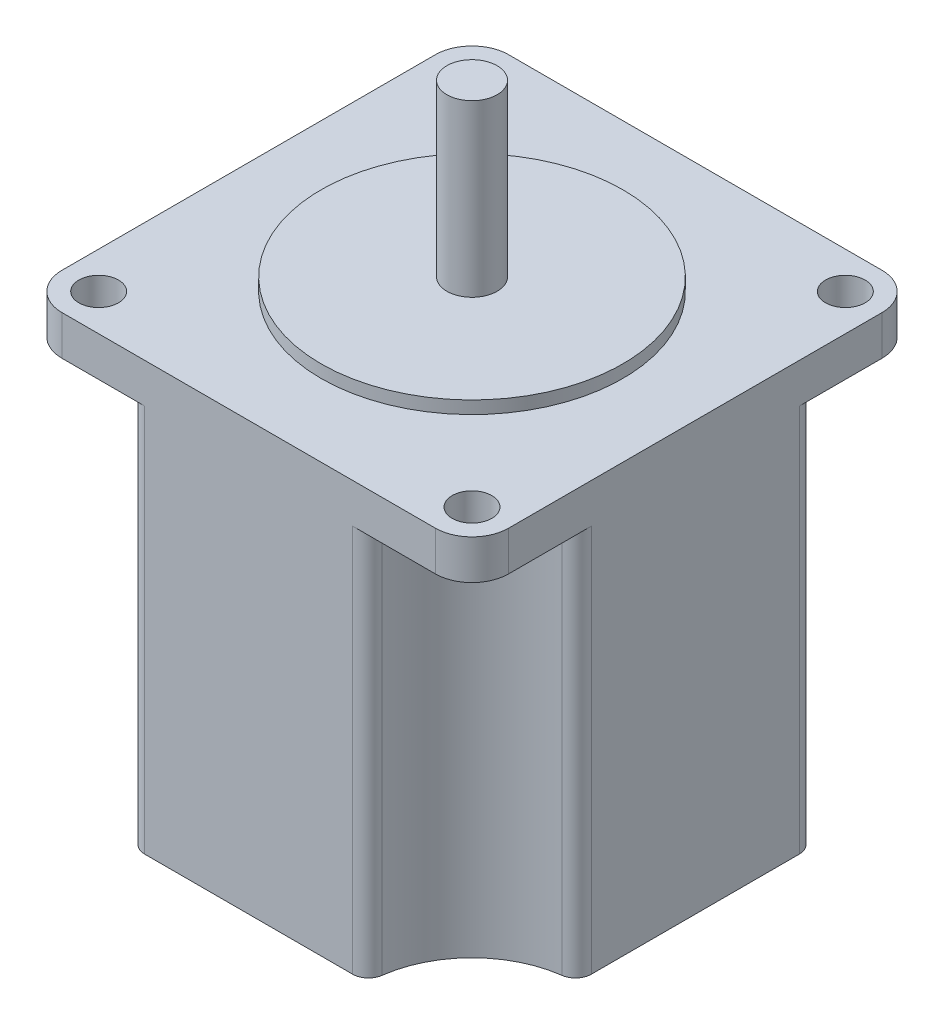
ISO-10303-21;
HEADER;
FILE_DESCRIPTION(('STEP AP214'),'2;1');
FILE_NAME('part.step','',(''),(''),'','','');
FILE_SCHEMA(('AUTOMOTIVE_DESIGN { 1 0 10303 214 1 1 1 1 }'));
ENDSEC;
DATA;
#1=APPLICATION_CONTEXT('core data for automotive mechanical design processes');
#2=APPLICATION_PROTOCOL_DEFINITION('international standard','automotive_design',2000,#1);
#3=PRODUCT_CONTEXT('',#1,'mechanical');
#4=PRODUCT('Part','Part','',(#3));
#5=PRODUCT_RELATED_PRODUCT_CATEGORY('part','',(#4));
#6=PRODUCT_DEFINITION_FORMATION('','',#4);
#7=PRODUCT_DEFINITION_CONTEXT('part definition',#1,'design');
#8=PRODUCT_DEFINITION('design','',#6,#7);
#9=PRODUCT_DEFINITION_SHAPE('','',#8);
#10=(LENGTH_UNIT() NAMED_UNIT(*) SI_UNIT(.MILLI.,.METRE.));
#11=(NAMED_UNIT(*) PLANE_ANGLE_UNIT() SI_UNIT($,.RADIAN.));
#12=(NAMED_UNIT(*) SI_UNIT($,.STERADIAN.) SOLID_ANGLE_UNIT());
#13=UNCERTAINTY_MEASURE_WITH_UNIT(LENGTH_MEASURE(1.E-05),#10,'distance_accuracy_value','');
#14=(GEOMETRIC_REPRESENTATION_CONTEXT(3) GLOBAL_UNCERTAINTY_ASSIGNED_CONTEXT((#13)) GLOBAL_UNIT_ASSIGNED_CONTEXT((#10,
#11,#12)) REPRESENTATION_CONTEXT('',''));
#15=CARTESIAN_POINT('',(0.,0.,0.));
#16=DIRECTION('',(0.,0.,1.));
#17=DIRECTION('',(1.,0.,0.));
#18=AXIS2_PLACEMENT_3D('',#15,#16,#17);
#19=CARTESIAN_POINT('',(28.2,55.6,-28.2));
#20=DIRECTION('',(0.,1.,0.));
#21=DIRECTION('',(0.,0.,1.));
#22=AXIS2_PLACEMENT_3D('',#19,#20,#21);
#23=PLANE('',#22);
#24=CARTESIAN_POINT('',(28.2,55.6,-28.2));
#25=DIRECTION('',(0.,1.,0.));
#26=DIRECTION('',(0.,0.,1.));
#27=AXIS2_PLACEMENT_3D('',#24,#25,#26);
#28=CIRCLE('',#27,19.05);
#29=CARTESIAN_POINT('',(28.2,55.6,-9.14999999999999));
#30=VERTEX_POINT('',#29);
#31=EDGE_CURVE('E366',#30,#30,#28,.T.);
#32=ORIENTED_EDGE('',*,*,#31,.T.);
#33=EDGE_LOOP('',(#32));
#34=FACE_BOUND('',#33,.T.);
#35=CARTESIAN_POINT('',(28.2,55.6,-28.2));
#36=DIRECTION('',(0.,1.,0.));
#37=DIRECTION('',(0.,0.,1.));
#38=AXIS2_PLACEMENT_3D('',#35,#36,#37);
#39=CIRCLE('',#38,3.175);
#40=CARTESIAN_POINT('',(28.2,55.6,-25.025));
#41=VERTEX_POINT('',#40);
#42=EDGE_CURVE('E622',#41,#41,#39,.T.);
#43=ORIENTED_EDGE('',*,*,#42,.F.);
#44=EDGE_LOOP('',(#43));
#45=FACE_BOUND('',#44,.T.);
#46=ADVANCED_FACE('F33',(#34,#45),#23,.T.);
#47=CARTESIAN_POINT('',(4.63,54.,-51.77));
#48=DIRECTION('',(0.,1.,0.));
#49=DIRECTION('',(0.,0.,1.));
#50=AXIS2_PLACEMENT_3D('',#47,#48,#49);
#51=PLANE('',#50);
#52=CARTESIAN_POINT('',(4.63,54.,-51.77));
#53=DIRECTION('',(0.,1.,0.));
#54=DIRECTION('',(0.,0.,1.));
#55=AXIS2_PLACEMENT_3D('',#52,#53,#54);
#56=CIRCLE('',#55,4.63);
#57=CARTESIAN_POINT('',(4.63,54.,-56.4));
#58=VERTEX_POINT('',#57);
#59=CARTESIAN_POINT('',(0.,54.,-51.77));
#60=VERTEX_POINT('',#59);
#61=EDGE_CURVE('E268',#58,#60,#56,.T.);
#62=ORIENTED_EDGE('',*,*,#61,.T.);
#63=DIRECTION('',(0.,0.,1.));
#64=VECTOR('',#63,1.);
#65=CARTESIAN_POINT('',(0.,54.,-51.77));
#66=LINE('',#65,#64);
#67=CARTESIAN_POINT('',(0.,54.,-4.63));
#68=VERTEX_POINT('',#67);
#69=EDGE_CURVE('E271',#60,#68,#66,.T.);
#70=ORIENTED_EDGE('',*,*,#69,.T.);
#71=CARTESIAN_POINT('',(4.63,54.,-4.63));
#72=DIRECTION('',(0.,1.,0.));
#73=DIRECTION('',(0.,0.,-1.));
#74=AXIS2_PLACEMENT_3D('',#71,#72,#73);
#75=CIRCLE('',#74,4.63);
#76=CARTESIAN_POINT('',(4.63,54.,0.));
#77=VERTEX_POINT('',#76);
#78=EDGE_CURVE('E274',#68,#77,#75,.T.);
#79=ORIENTED_EDGE('',*,*,#78,.T.);
#80=DIRECTION('',(1.,0.,0.));
#81=VECTOR('',#80,1.);
#82=CARTESIAN_POINT('',(4.63,54.,0.));
#83=LINE('',#82,#81);
#84=CARTESIAN_POINT('',(51.77,54.,0.));
#85=VERTEX_POINT('',#84);
#86=EDGE_CURVE('E276',#77,#85,#83,.T.);
#87=ORIENTED_EDGE('',*,*,#86,.T.);
#88=CARTESIAN_POINT('',(51.77,54.,-4.63));
#89=DIRECTION('',(0.,1.,0.));
#90=DIRECTION('',(0.,0.,1.));
#91=AXIS2_PLACEMENT_3D('',#88,#89,#90);
#92=CIRCLE('',#91,4.63);
#93=CARTESIAN_POINT('',(56.4,54.,-4.63));
#94=VERTEX_POINT('',#93);
#95=EDGE_CURVE('E278',#85,#94,#92,.T.);
#96=ORIENTED_EDGE('',*,*,#95,.T.);
#97=DIRECTION('',(0.,0.,-1.));
#98=VECTOR('',#97,1.);
#99=CARTESIAN_POINT('',(56.4,54.,-51.77));
#100=LINE('',#99,#98);
#101=CARTESIAN_POINT('',(56.4,54.,-51.77));
#102=VERTEX_POINT('',#101);
#103=EDGE_CURVE('E280',#94,#102,#100,.T.);
#104=ORIENTED_EDGE('',*,*,#103,.T.);
#105=CARTESIAN_POINT('',(51.77,54.,-51.77));
#106=DIRECTION('',(0.,1.,0.));
#107=DIRECTION('',(0.,0.,-1.));
#108=AXIS2_PLACEMENT_3D('',#105,#106,#107);
#109=CIRCLE('',#108,4.63);
#110=CARTESIAN_POINT('',(51.77,54.,-56.4));
#111=VERTEX_POINT('',#110);
#112=EDGE_CURVE('E282',#102,#111,#109,.T.);
#113=ORIENTED_EDGE('',*,*,#112,.T.);
#114=DIRECTION('',(-1.,0.,0.));
#115=VECTOR('',#114,1.);
#116=CARTESIAN_POINT('',(4.63,54.,-56.4));
#117=LINE('',#116,#115);
#118=EDGE_CURVE('E284',#111,#58,#117,.T.);
#119=ORIENTED_EDGE('',*,*,#118,.T.);
#120=EDGE_LOOP('',(#62,#70,#79,#87,#96,#104,#113,#119));
#121=FACE_BOUND('',#120,.T.);
#122=CARTESIAN_POINT('',(4.63,54.,-51.77));
#123=DIRECTION('',(0.,1.,0.));
#124=DIRECTION('',(0.,0.,1.));
#125=AXIS2_PLACEMENT_3D('',#122,#123,#124);
#126=CIRCLE('',#125,2.5);
#127=CARTESIAN_POINT('',(4.63,54.,-49.27));
#128=VERTEX_POINT('',#127);
#129=EDGE_CURVE('E265',#128,#128,#126,.T.);
#130=ORIENTED_EDGE('',*,*,#129,.F.);
#131=EDGE_LOOP('',(#130));
#132=FACE_BOUND('',#131,.T.);
#133=CARTESIAN_POINT('',(51.77,54.,-51.77));
#134=DIRECTION('',(0.,1.,0.));
#135=DIRECTION('',(0.,0.,-1.));
#136=AXIS2_PLACEMENT_3D('',#133,#134,#135);
#137=CIRCLE('',#136,2.5);
#138=CARTESIAN_POINT('',(51.77,54.,-54.27));
#139=VERTEX_POINT('',#138);
#140=EDGE_CURVE('E262',#139,#139,#137,.T.);
#141=ORIENTED_EDGE('',*,*,#140,.F.);
#142=EDGE_LOOP('',(#141));
#143=FACE_BOUND('',#142,.T.);
#144=CARTESIAN_POINT('',(51.77,54.,-4.63000000000001));
#145=DIRECTION('',(0.,1.,0.));
#146=DIRECTION('',(0.,0.,1.));
#147=AXIS2_PLACEMENT_3D('',#144,#145,#146);
#148=CIRCLE('',#147,2.5);
#149=CARTESIAN_POINT('',(51.77,54.,-2.13000000000001));
#150=VERTEX_POINT('',#149);
#151=EDGE_CURVE('E259',#150,#150,#148,.T.);
#152=ORIENTED_EDGE('',*,*,#151,.F.);
#153=EDGE_LOOP('',(#152));
#154=FACE_BOUND('',#153,.T.);
#155=CARTESIAN_POINT('',(4.63,54.,-4.63));
#156=DIRECTION('',(0.,1.,0.));
#157=DIRECTION('',(0.,0.,-1.));
#158=AXIS2_PLACEMENT_3D('',#155,#156,#157);
#159=CIRCLE('',#158,2.5);
#160=CARTESIAN_POINT('',(4.63,54.,-7.13));
#161=VERTEX_POINT('',#160);
#162=EDGE_CURVE('E207',#161,#161,#159,.T.);
#163=ORIENTED_EDGE('',*,*,#162,.F.);
#164=EDGE_LOOP('',(#163));
#165=FACE_BOUND('',#164,.T.);
#166=CARTESIAN_POINT('',(28.2,54.,-28.2));
#167=DIRECTION('',(0.,1.,0.));
#168=DIRECTION('',(0.,0.,1.));
#169=AXIS2_PLACEMENT_3D('',#166,#167,#168);
#170=CIRCLE('',#169,19.05);
#171=CARTESIAN_POINT('',(28.2,54.,-9.14999999999999));
#172=VERTEX_POINT('',#171);
#173=EDGE_CURVE('E621',#172,#172,#170,.T.);
#174=ORIENTED_EDGE('',*,*,#173,.F.);
#175=EDGE_LOOP('',(#174));
#176=FACE_BOUND('',#175,.T.);
#177=ADVANCED_FACE('F321',(#121,#132,#143,#154,#165,#176),#51,.T.);
#178=CARTESIAN_POINT('',(4.63,54.,-51.77));
#179=DIRECTION('',(0.,-1.,0.));
#180=DIRECTION('',(0.,0.,-1.));
#181=AXIS2_PLACEMENT_3D('',#178,#179,#180);
#182=CYLINDRICAL_SURFACE('',#181,4.63);
#183=CARTESIAN_POINT('',(4.63,49.,-51.77));
#184=DIRECTION('',(0.,-1.,0.));
#185=DIRECTION('',(0.,0.,-1.));
#186=AXIS2_PLACEMENT_3D('',#183,#184,#185);
#187=CIRCLE('',#186,4.63);
#188=CARTESIAN_POINT('',(0.,49.,-51.77));
#189=VERTEX_POINT('',#188);
#190=CARTESIAN_POINT('',(4.63,49.,-56.4));
#191=VERTEX_POINT('',#190);
#192=EDGE_CURVE('E249',#189,#191,#187,.T.);
#193=ORIENTED_EDGE('',*,*,#192,.F.);
#194=DIRECTION('',(0.,-1.,0.));
#195=VECTOR('',#194,1.);
#196=CARTESIAN_POINT('',(0.,54.,-51.77));
#197=LINE('',#196,#195);
#198=EDGE_CURVE('E12',#60,#189,#197,.T.);
#199=ORIENTED_EDGE('',*,*,#198,.F.);
#200=ORIENTED_EDGE('',*,*,#61,.F.);
#201=DIRECTION('',(0.,-1.,0.));
#202=VECTOR('',#201,1.);
#203=CARTESIAN_POINT('',(4.63,54.,-56.4));
#204=LINE('',#203,#202);
#205=EDGE_CURVE('E286',#58,#191,#204,.T.);
#206=ORIENTED_EDGE('',*,*,#205,.T.);
#207=EDGE_LOOP('',(#193,#199,#200,#206));
#208=FACE_BOUND('',#207,.T.);
#209=ADVANCED_FACE('F35',(#208),#182,.T.);
#210=CARTESIAN_POINT('',(0.,54.,-51.77));
#211=DIRECTION('',(1.,0.,0.));
#212=DIRECTION('',(0.,0.,-1.));
#213=AXIS2_PLACEMENT_3D('',#210,#211,#212);
#214=PLANE('',#213);
#215=DIRECTION('',(0.,-1.,0.));
#216=VECTOR('',#215,1.);
#217=CARTESIAN_POINT('',(0.,49.,-15.0678465614699));
#218=LINE('',#217,#216);
#219=CARTESIAN_POINT('',(0.,49.,-15.0678465614699));
#220=VERTEX_POINT('',#219);
#221=CARTESIAN_POINT('',(0.,0.,-15.0678465614699));
#222=VERTEX_POINT('',#221);
#223=EDGE_CURVE('E213',#220,#222,#218,.T.);
#224=ORIENTED_EDGE('',*,*,#223,.F.);
#225=DIRECTION('',(0.,0.,-1.));
#226=VECTOR('',#225,1.);
#227=CARTESIAN_POINT('',(0.,49.,-51.77));
#228=LINE('',#227,#226);
#229=CARTESIAN_POINT('',(0.,49.,-4.63));
#230=VERTEX_POINT('',#229);
#231=EDGE_CURVE('E195',#230,#220,#228,.T.);
#232=ORIENTED_EDGE('',*,*,#231,.F.);
#233=DIRECTION('',(0.,-1.,0.));
#234=VECTOR('',#233,1.);
#235=CARTESIAN_POINT('',(0.,54.,-4.63));
#236=LINE('',#235,#234);
#237=EDGE_CURVE('E42',#68,#230,#236,.T.);
#238=ORIENTED_EDGE('',*,*,#237,.F.);
#239=ORIENTED_EDGE('',*,*,#69,.F.);
#240=ORIENTED_EDGE('',*,*,#198,.T.);
#241=CARTESIAN_POINT('',(0.,49.,-41.3321534385301));
#242=VERTEX_POINT('',#241);
#243=EDGE_CURVE('E209',#242,#189,#228,.T.);
#244=ORIENTED_EDGE('',*,*,#243,.F.);
#245=DIRECTION('',(0.,-1.,0.));
#246=VECTOR('',#245,1.);
#247=CARTESIAN_POINT('',(0.,49.,-41.3321534385301));
#248=LINE('',#247,#246);
#249=CARTESIAN_POINT('',(0.,0.,-41.3321534385301));
#250=VERTEX_POINT('',#249);
#251=EDGE_CURVE('E223',#242,#250,#248,.T.);
#252=ORIENTED_EDGE('',*,*,#251,.T.);
#253=DIRECTION('',(0.,0.,1.));
#254=VECTOR('',#253,1.);
#255=CARTESIAN_POINT('',(0.,0.,-51.77));
#256=LINE('',#255,#254);
#257=EDGE_CURVE('E222',#250,#222,#256,.T.);
#258=ORIENTED_EDGE('',*,*,#257,.T.);
#259=EDGE_LOOP('',(#224,#232,#238,#239,#240,#244,#252,#258));
#260=FACE_BOUND('',#259,.T.);
#261=ADVANCED_FACE('F219',(#260),#214,.F.);
#262=CARTESIAN_POINT('',(4.63,54.,-4.63));
#263=DIRECTION('',(0.,-1.,0.));
#264=DIRECTION('',(0.,0.,-1.));
#265=AXIS2_PLACEMENT_3D('',#262,#263,#264);
#266=CYLINDRICAL_SURFACE('',#265,4.63);
#267=CARTESIAN_POINT('',(4.63,49.,-4.63));
#268=DIRECTION('',(0.,-1.,0.));
#269=DIRECTION('',(0.,0.,-1.));
#270=AXIS2_PLACEMENT_3D('',#267,#268,#269);
#271=CIRCLE('',#270,4.63);
#272=CARTESIAN_POINT('',(4.63,49.,0.));
#273=VERTEX_POINT('',#272);
#274=EDGE_CURVE('E202',#273,#230,#271,.T.);
#275=ORIENTED_EDGE('',*,*,#274,.F.);
#276=DIRECTION('',(0.,-1.,0.));
#277=VECTOR('',#276,1.);
#278=CARTESIAN_POINT('',(4.63,54.,0.));
#279=LINE('',#278,#277);
#280=EDGE_CURVE('E310',#77,#273,#279,.T.);
#281=ORIENTED_EDGE('',*,*,#280,.F.);
#282=ORIENTED_EDGE('',*,*,#78,.F.);
#283=ORIENTED_EDGE('',*,*,#237,.T.);
#284=EDGE_LOOP('',(#275,#281,#282,#283));
#285=FACE_BOUND('',#284,.T.);
#286=ADVANCED_FACE('F315',(#285),#266,.T.);
#287=CARTESIAN_POINT('',(51.77,54.,-4.63));
#288=DIRECTION('',(0.,-1.,0.));
#289=DIRECTION('',(0.,0.,-1.));
#290=AXIS2_PLACEMENT_3D('',#287,#288,#289);
#291=CYLINDRICAL_SURFACE('',#290,4.63);
#292=CARTESIAN_POINT('',(51.77,49.,-4.63));
#293=DIRECTION('',(0.,-1.,0.));
#294=DIRECTION('',(0.,0.,-1.));
#295=AXIS2_PLACEMENT_3D('',#292,#293,#294);
#296=CIRCLE('',#295,4.63);
#297=CARTESIAN_POINT('',(56.4,49.,-4.63));
#298=VERTEX_POINT('',#297);
#299=CARTESIAN_POINT('',(51.77,49.,0.));
#300=VERTEX_POINT('',#299);
#301=EDGE_CURVE('E251',#298,#300,#296,.T.);
#302=ORIENTED_EDGE('',*,*,#301,.F.);
#303=DIRECTION('',(0.,-1.,0.));
#304=VECTOR('',#303,1.);
#305=CARTESIAN_POINT('',(56.4,54.,-4.63));
#306=LINE('',#305,#304);
#307=EDGE_CURVE('E304',#94,#298,#306,.T.);
#308=ORIENTED_EDGE('',*,*,#307,.F.);
#309=ORIENTED_EDGE('',*,*,#95,.F.);
#310=DIRECTION('',(0.,-1.,0.));
#311=VECTOR('',#310,1.);
#312=CARTESIAN_POINT('',(51.77,54.,0.));
#313=LINE('',#312,#311);
#314=EDGE_CURVE('E307',#85,#300,#313,.T.);
#315=ORIENTED_EDGE('',*,*,#314,.T.);
#316=EDGE_LOOP('',(#302,#308,#309,#315));
#317=FACE_BOUND('',#316,.T.);
#318=ADVANCED_FACE('F458',(#317),#291,.T.);
#319=CARTESIAN_POINT('',(51.77,54.,-51.77));
#320=DIRECTION('',(0.,-1.,0.));
#321=DIRECTION('',(0.,0.,-1.));
#322=AXIS2_PLACEMENT_3D('',#319,#320,#321);
#323=CYLINDRICAL_SURFACE('',#322,4.63);
#324=CARTESIAN_POINT('',(51.77,49.,-51.77));
#325=DIRECTION('',(0.,-1.,0.));
#326=DIRECTION('',(0.,0.,-1.));
#327=AXIS2_PLACEMENT_3D('',#324,#325,#326);
#328=CIRCLE('',#327,4.63);
#329=CARTESIAN_POINT('',(51.77,49.,-56.4));
#330=VERTEX_POINT('',#329);
#331=CARTESIAN_POINT('',(56.4,49.,-51.77));
#332=VERTEX_POINT('',#331);
#333=EDGE_CURVE('E243',#330,#332,#328,.T.);
#334=ORIENTED_EDGE('',*,*,#333,.F.);
#335=DIRECTION('',(0.,-1.,0.));
#336=VECTOR('',#335,1.);
#337=CARTESIAN_POINT('',(51.77,54.,-56.4));
#338=LINE('',#337,#336);
#339=EDGE_CURVE('E298',#111,#330,#338,.T.);
#340=ORIENTED_EDGE('',*,*,#339,.F.);
#341=ORIENTED_EDGE('',*,*,#112,.F.);
#342=DIRECTION('',(0.,-1.,0.));
#343=VECTOR('',#342,1.);
#344=CARTESIAN_POINT('',(56.4,54.,-51.77));
#345=LINE('',#344,#343);
#346=EDGE_CURVE('E301',#102,#332,#345,.T.);
#347=ORIENTED_EDGE('',*,*,#346,.T.);
#348=EDGE_LOOP('',(#334,#340,#341,#347));
#349=FACE_BOUND('',#348,.T.);
#350=ADVANCED_FACE('F468',(#349),#323,.T.);
#351=CARTESIAN_POINT('',(4.63,0.,-51.77));
#352=DIRECTION('',(0.,1.,0.));
#353=DIRECTION('',(0.,0.,1.));
#354=AXIS2_PLACEMENT_3D('',#351,#352,#353);
#355=PLANE('',#354);
#356=CARTESIAN_POINT('',(2.,0.,-15.0678465614699));
#357=DIRECTION('',(0.,-1.,0.));
#358=DIRECTION('',(0.,0.,-1.));
#359=AXIS2_PLACEMENT_3D('',#356,#357,#358);
#360=CIRCLE('',#359,2.);
#361=CARTESIAN_POINT('',(1.73684210526316,0.,-13.0852351718028));
#362=VERTEX_POINT('',#361);
#363=EDGE_CURVE('E362',#362,#222,#360,.T.);
#364=ORIENTED_EDGE('',*,*,#363,.T.);
#365=ORIENTED_EDGE('',*,*,#257,.F.);
#366=CARTESIAN_POINT('',(2.,0.,-41.3321534385301));
#367=DIRECTION('',(0.,-1.,0.));
#368=DIRECTION('',(0.,0.,1.));
#369=AXIS2_PLACEMENT_3D('',#366,#367,#368);
#370=CIRCLE('',#369,2.);
#371=CARTESIAN_POINT('',(1.73684210526316,0.,-43.3147648281972));
#372=VERTEX_POINT('',#371);
#373=EDGE_CURVE('E354',#250,#372,#370,.T.);
#374=ORIENTED_EDGE('',*,*,#373,.T.);
#375=CARTESIAN_POINT('',(0.,0.,-56.4));
#376=DIRECTION('',(0.,1.,0.));
#377=DIRECTION('',(0.,0.,1.));
#378=AXIS2_PLACEMENT_3D('',#375,#376,#377);
#379=CIRCLE('',#378,13.2);
#380=CARTESIAN_POINT('',(13.0852351718028,0.,-54.6631578947368));
#381=VERTEX_POINT('',#380);
#382=EDGE_CURVE('E361',#372,#381,#379,.T.);
#383=ORIENTED_EDGE('',*,*,#382,.T.);
#384=CARTESIAN_POINT('',(15.0678465614699,0.,-54.4));
#385=DIRECTION('',(0.,-1.,0.));
#386=DIRECTION('',(0.,0.,1.));
#387=AXIS2_PLACEMENT_3D('',#384,#385,#386);
#388=CIRCLE('',#387,2.);
#389=CARTESIAN_POINT('',(15.0678465614699,0.,-56.4));
#390=VERTEX_POINT('',#389);
#391=EDGE_CURVE('E364',#381,#390,#388,.T.);
#392=ORIENTED_EDGE('',*,*,#391,.T.);
#393=DIRECTION('',(-1.,0.,0.));
#394=VECTOR('',#393,1.);
#395=CARTESIAN_POINT('',(4.63,0.,-56.4));
#396=LINE('',#395,#394);
#397=CARTESIAN_POINT('',(41.3321534385301,0.,-56.4));
#398=VERTEX_POINT('',#397);
#399=EDGE_CURVE('E272',#398,#390,#396,.T.);
#400=ORIENTED_EDGE('',*,*,#399,.F.);
#401=CARTESIAN_POINT('',(41.3321534385301,0.,-54.4));
#402=DIRECTION('',(0.,-1.,0.));
#403=DIRECTION('',(0.,0.,-1.));
#404=AXIS2_PLACEMENT_3D('',#401,#402,#403);
#405=CIRCLE('',#404,2.);
#406=CARTESIAN_POINT('',(43.3147648281972,0.,-54.6631578947368));
#407=VERTEX_POINT('',#406);
#408=EDGE_CURVE('E370',#398,#407,#405,.T.);
#409=ORIENTED_EDGE('',*,*,#408,.T.);
#410=CARTESIAN_POINT('',(56.4,0.,-56.4));
#411=DIRECTION('',(0.,1.,0.));
#412=DIRECTION('',(0.,0.,-1.));
#413=AXIS2_PLACEMENT_3D('',#410,#411,#412);
#414=CIRCLE('',#413,13.2);
#415=CARTESIAN_POINT('',(54.6631578947368,0.,-43.3147648281972));
#416=VERTEX_POINT('',#415);
#417=EDGE_CURVE('E373',#407,#416,#414,.T.);
#418=ORIENTED_EDGE('',*,*,#417,.T.);
#419=CARTESIAN_POINT('',(54.4,0.,-41.3321534385301));
#420=DIRECTION('',(0.,-1.,0.));
#421=DIRECTION('',(0.,0.,-1.));
#422=AXIS2_PLACEMENT_3D('',#419,#420,#421);
#423=CIRCLE('',#422,2.);
#424=CARTESIAN_POINT('',(56.4,0.,-41.3321534385301));
#425=VERTEX_POINT('',#424);
#426=EDGE_CURVE('E376',#416,#425,#423,.T.);
#427=ORIENTED_EDGE('',*,*,#426,.T.);
#428=DIRECTION('',(0.,0.,-1.));
#429=VECTOR('',#428,1.);
#430=CARTESIAN_POINT('',(56.4,0.,-51.77));
#431=LINE('',#430,#429);
#432=CARTESIAN_POINT('',(56.4,0.,-15.0678465614699));
#433=VERTEX_POINT('',#432);
#434=EDGE_CURVE('E291',#433,#425,#431,.T.);
#435=ORIENTED_EDGE('',*,*,#434,.F.);
#436=CARTESIAN_POINT('',(54.4,0.,-15.0678465614699));
#437=DIRECTION('',(0.,-1.,0.));
#438=DIRECTION('',(0.,0.,1.));
#439=AXIS2_PLACEMENT_3D('',#436,#437,#438);
#440=CIRCLE('',#439,2.);
#441=CARTESIAN_POINT('',(54.6631578947368,0.,-13.0852351718028));
#442=VERTEX_POINT('',#441);
#443=EDGE_CURVE('E379',#433,#442,#440,.T.);
#444=ORIENTED_EDGE('',*,*,#443,.T.);
#445=CARTESIAN_POINT('',(56.4,0.,0.));
#446=DIRECTION('',(0.,1.,0.));
#447=DIRECTION('',(0.,0.,1.));
#448=AXIS2_PLACEMENT_3D('',#445,#446,#447);
#449=CIRCLE('',#448,13.2);
#450=CARTESIAN_POINT('',(43.3147648281972,0.,-1.73684210526315));
#451=VERTEX_POINT('',#450);
#452=EDGE_CURVE('E57',#442,#451,#449,.T.);
#453=ORIENTED_EDGE('',*,*,#452,.T.);
#454=CARTESIAN_POINT('',(41.3321534385301,0.,-1.99999999999999));
#455=DIRECTION('',(0.,-1.,0.));
#456=DIRECTION('',(0.,0.,1.));
#457=AXIS2_PLACEMENT_3D('',#454,#455,#456);
#458=CIRCLE('',#457,2.);
#459=CARTESIAN_POINT('',(41.3321534385301,0.,0.));
#460=VERTEX_POINT('',#459);
#461=EDGE_CURVE('E383',#451,#460,#458,.T.);
#462=ORIENTED_EDGE('',*,*,#461,.T.);
#463=DIRECTION('',(1.,0.,0.));
#464=VECTOR('',#463,1.);
#465=CARTESIAN_POINT('',(4.63,0.,0.));
#466=LINE('',#465,#464);
#467=CARTESIAN_POINT('',(15.0678465614699,0.,0.));
#468=VERTEX_POINT('',#467);
#469=EDGE_CURVE('E288',#468,#460,#466,.T.);
#470=ORIENTED_EDGE('',*,*,#469,.F.);
#471=CARTESIAN_POINT('',(15.0678465614699,0.,-2.));
#472=DIRECTION('',(0.,-1.,0.));
#473=DIRECTION('',(0.,0.,-1.));
#474=AXIS2_PLACEMENT_3D('',#471,#472,#473);
#475=CIRCLE('',#474,2.);
#476=CARTESIAN_POINT('',(13.0852351718028,0.,-1.73684210526316));
#477=VERTEX_POINT('',#476);
#478=EDGE_CURVE('E386',#468,#477,#475,.T.);
#479=ORIENTED_EDGE('',*,*,#478,.T.);
#480=CARTESIAN_POINT('',(0.,0.,0.));
#481=DIRECTION('',(0.,1.,0.));
#482=DIRECTION('',(0.,0.,-1.));
#483=AXIS2_PLACEMENT_3D('',#480,#481,#482);
#484=CIRCLE('',#483,13.2);
#485=EDGE_CURVE('E49',#477,#362,#484,.T.);
#486=ORIENTED_EDGE('',*,*,#485,.T.);
#487=EDGE_LOOP('',(#364,#365,#374,#383,#392,#400,#409,#418,#427,#435,#444,#453,#462,#470,#479,#486));
#488=FACE_BOUND('',#487,.T.);
#489=ADVANCED_FACE('F360',(#488),#355,.F.);
#490=CARTESIAN_POINT('',(4.63,0.,-51.77));
#491=DIRECTION('',(0.,1.,0.));
#492=DIRECTION('',(0.,0.,1.));
#493=AXIS2_PLACEMENT_3D('',#490,#491,#492);
#494=CYLINDRICAL_SURFACE('',#493,2.5);
#495=ORIENTED_EDGE('',*,*,#129,.T.);
#496=EDGE_LOOP('',(#495));
#497=FACE_BOUND('',#496,.T.);
#498=CARTESIAN_POINT('',(4.63,49.,-51.77));
#499=DIRECTION('',(0.,-1.,0.));
#500=DIRECTION('',(0.,0.,-1.));
#501=AXIS2_PLACEMENT_3D('',#498,#499,#500);
#502=CIRCLE('',#501,2.5);
#503=CARTESIAN_POINT('',(4.63,49.,-54.27));
#504=VERTEX_POINT('',#503);
#505=EDGE_CURVE('E238',#504,#504,#502,.F.);
#506=ORIENTED_EDGE('',*,*,#505,.F.);
#507=EDGE_LOOP('',(#506));
#508=FACE_BOUND('',#507,.T.);
#509=ADVANCED_FACE('F547',(#497,#508),#494,.F.);
#510=CARTESIAN_POINT('',(51.77,0.,-51.77));
#511=DIRECTION('',(0.,1.,0.));
#512=DIRECTION('',(0.,0.,1.));
#513=AXIS2_PLACEMENT_3D('',#510,#511,#512);
#514=CYLINDRICAL_SURFACE('',#513,2.5);
#515=ORIENTED_EDGE('',*,*,#140,.T.);
#516=EDGE_LOOP('',(#515));
#517=FACE_BOUND('',#516,.T.);
#518=CARTESIAN_POINT('',(51.77,49.,-51.77));
#519=DIRECTION('',(0.,-1.,0.));
#520=DIRECTION('',(0.,0.,-1.));
#521=AXIS2_PLACEMENT_3D('',#518,#519,#520);
#522=CIRCLE('',#521,2.5);
#523=CARTESIAN_POINT('',(51.77,49.,-54.27));
#524=VERTEX_POINT('',#523);
#525=EDGE_CURVE('E235',#524,#524,#522,.F.);
#526=ORIENTED_EDGE('',*,*,#525,.F.);
#527=EDGE_LOOP('',(#526));
#528=FACE_BOUND('',#527,.T.);
#529=ADVANCED_FACE('F549',(#517,#528),#514,.F.);
#530=CARTESIAN_POINT('',(51.77,0.,-4.63000000000001));
#531=DIRECTION('',(0.,1.,0.));
#532=DIRECTION('',(0.,0.,1.));
#533=AXIS2_PLACEMENT_3D('',#530,#531,#532);
#534=CYLINDRICAL_SURFACE('',#533,2.5);
#535=ORIENTED_EDGE('',*,*,#151,.T.);
#536=EDGE_LOOP('',(#535));
#537=FACE_BOUND('',#536,.T.);
#538=CARTESIAN_POINT('',(51.77,49.,-4.63000000000001));
#539=DIRECTION('',(0.,-1.,0.));
#540=DIRECTION('',(0.,0.,-1.));
#541=AXIS2_PLACEMENT_3D('',#538,#539,#540);
#542=CIRCLE('',#541,2.5);
#543=CARTESIAN_POINT('',(51.77,49.,-7.13000000000001));
#544=VERTEX_POINT('',#543);
#545=EDGE_CURVE('E232',#544,#544,#542,.F.);
#546=ORIENTED_EDGE('',*,*,#545,.F.);
#547=EDGE_LOOP('',(#546));
#548=FACE_BOUND('',#547,.T.);
#549=ADVANCED_FACE('F556',(#537,#548),#534,.F.);
#550=CARTESIAN_POINT('',(4.63,0.,-4.63));
#551=DIRECTION('',(0.,1.,0.));
#552=DIRECTION('',(0.,0.,1.));
#553=AXIS2_PLACEMENT_3D('',#550,#551,#552);
#554=CYLINDRICAL_SURFACE('',#553,2.5);
#555=ORIENTED_EDGE('',*,*,#162,.T.);
#556=EDGE_LOOP('',(#555));
#557=FACE_BOUND('',#556,.T.);
#558=CARTESIAN_POINT('',(4.63,49.,-4.63));
#559=DIRECTION('',(0.,-1.,0.));
#560=DIRECTION('',(0.,0.,-1.));
#561=AXIS2_PLACEMENT_3D('',#558,#559,#560);
#562=CIRCLE('',#561,2.5);
#563=CARTESIAN_POINT('',(4.63,49.,-7.13));
#564=VERTEX_POINT('',#563);
#565=EDGE_CURVE('E37',#564,#564,#562,.F.);
#566=ORIENTED_EDGE('',*,*,#565,.F.);
#567=EDGE_LOOP('',(#566));
#568=FACE_BOUND('',#567,.T.);
#569=ADVANCED_FACE('F570',(#557,#568),#554,.F.);
#570=CARTESIAN_POINT('',(4.63,54.,0.));
#571=DIRECTION('',(0.,0.,-1.));
#572=DIRECTION('',(-1.,0.,0.));
#573=AXIS2_PLACEMENT_3D('',#570,#571,#572);
#574=PLANE('',#573);
#575=DIRECTION('',(0.,-1.,0.));
#576=VECTOR('',#575,1.);
#577=CARTESIAN_POINT('',(41.3321534385301,49.,0.));
#578=LINE('',#577,#576);
#579=CARTESIAN_POINT('',(41.3321534385301,49.,0.));
#580=VERTEX_POINT('',#579);
#581=EDGE_CURVE('E396',#580,#460,#578,.T.);
#582=ORIENTED_EDGE('',*,*,#581,.F.);
#583=DIRECTION('',(-1.,0.,0.));
#584=VECTOR('',#583,1.);
#585=CARTESIAN_POINT('',(4.63,49.,0.));
#586=LINE('',#585,#584);
#587=EDGE_CURVE('E253',#300,#580,#586,.T.);
#588=ORIENTED_EDGE('',*,*,#587,.F.);
#589=ORIENTED_EDGE('',*,*,#314,.F.);
#590=ORIENTED_EDGE('',*,*,#86,.F.);
#591=ORIENTED_EDGE('',*,*,#280,.T.);
#592=CARTESIAN_POINT('',(15.0678465614699,49.,0.));
#593=VERTEX_POINT('',#592);
#594=EDGE_CURVE('E255',#593,#273,#586,.T.);
#595=ORIENTED_EDGE('',*,*,#594,.F.);
#596=DIRECTION('',(0.,-1.,0.));
#597=VECTOR('',#596,1.);
#598=CARTESIAN_POINT('',(15.0678465614699,49.,0.));
#599=LINE('',#598,#597);
#600=EDGE_CURVE('E393',#593,#468,#599,.T.);
#601=ORIENTED_EDGE('',*,*,#600,.T.);
#602=ORIENTED_EDGE('',*,*,#469,.T.);
#603=EDGE_LOOP('',(#582,#588,#589,#590,#591,#595,#601,#602));
#604=FACE_BOUND('',#603,.T.);
#605=ADVANCED_FACE('F447',(#604),#574,.F.);
#606=CARTESIAN_POINT('',(56.4,54.,-51.77));
#607=DIRECTION('',(-1.,0.,0.));
#608=DIRECTION('',(0.,0.,1.));
#609=AXIS2_PLACEMENT_3D('',#606,#607,#608);
#610=PLANE('',#609);
#611=DIRECTION('',(0.,-1.,0.));
#612=VECTOR('',#611,1.);
#613=CARTESIAN_POINT('',(56.4,49.,-41.3321534385301));
#614=LINE('',#613,#612);
#615=CARTESIAN_POINT('',(56.4,49.,-41.3321534385301));
#616=VERTEX_POINT('',#615);
#617=EDGE_CURVE('E405',#616,#425,#614,.T.);
#618=ORIENTED_EDGE('',*,*,#617,.F.);
#619=DIRECTION('',(0.,0.,1.));
#620=VECTOR('',#619,1.);
#621=CARTESIAN_POINT('',(56.4,49.,-51.77));
#622=LINE('',#621,#620);
#623=EDGE_CURVE('E246',#332,#616,#622,.T.);
#624=ORIENTED_EDGE('',*,*,#623,.F.);
#625=ORIENTED_EDGE('',*,*,#346,.F.);
#626=ORIENTED_EDGE('',*,*,#103,.F.);
#627=ORIENTED_EDGE('',*,*,#307,.T.);
#628=CARTESIAN_POINT('',(56.4,49.,-15.0678465614699));
#629=VERTEX_POINT('',#628);
#630=EDGE_CURVE('E248',#629,#298,#622,.T.);
#631=ORIENTED_EDGE('',*,*,#630,.F.);
#632=DIRECTION('',(0.,-1.,0.));
#633=VECTOR('',#632,1.);
#634=CARTESIAN_POINT('',(56.4,49.,-15.0678465614699));
#635=LINE('',#634,#633);
#636=EDGE_CURVE('E402',#629,#433,#635,.T.);
#637=ORIENTED_EDGE('',*,*,#636,.T.);
#638=ORIENTED_EDGE('',*,*,#434,.T.);
#639=EDGE_LOOP('',(#618,#624,#625,#626,#627,#631,#637,#638));
#640=FACE_BOUND('',#639,.T.);
#641=ADVANCED_FACE('F462',(#640),#610,.F.);
#642=CARTESIAN_POINT('',(4.63,54.,-56.4));
#643=DIRECTION('',(0.,0.,1.));
#644=DIRECTION('',(1.,0.,0.));
#645=AXIS2_PLACEMENT_3D('',#642,#643,#644);
#646=PLANE('',#645);
#647=DIRECTION('',(0.,-1.,0.));
#648=VECTOR('',#647,1.);
#649=CARTESIAN_POINT('',(15.0678465614699,49.,-56.4));
#650=LINE('',#649,#648);
#651=CARTESIAN_POINT('',(15.0678465614699,49.,-56.4));
#652=VERTEX_POINT('',#651);
#653=EDGE_CURVE('E335',#652,#390,#650,.T.);
#654=ORIENTED_EDGE('',*,*,#653,.F.);
#655=DIRECTION('',(1.,0.,0.));
#656=VECTOR('',#655,1.);
#657=CARTESIAN_POINT('',(4.63,49.,-56.4));
#658=LINE('',#657,#656);
#659=EDGE_CURVE('E244',#191,#652,#658,.T.);
#660=ORIENTED_EDGE('',*,*,#659,.F.);
#661=ORIENTED_EDGE('',*,*,#205,.F.);
#662=ORIENTED_EDGE('',*,*,#118,.F.);
#663=ORIENTED_EDGE('',*,*,#339,.T.);
#664=CARTESIAN_POINT('',(41.3321534385301,49.,-56.4));
#665=VERTEX_POINT('',#664);
#666=EDGE_CURVE('E241',#665,#330,#658,.T.);
#667=ORIENTED_EDGE('',*,*,#666,.F.);
#668=DIRECTION('',(0.,-1.,0.));
#669=VECTOR('',#668,1.);
#670=CARTESIAN_POINT('',(41.3321534385301,49.,-56.4));
#671=LINE('',#670,#669);
#672=EDGE_CURVE('E341',#665,#398,#671,.T.);
#673=ORIENTED_EDGE('',*,*,#672,.T.);
#674=ORIENTED_EDGE('',*,*,#399,.T.);
#675=EDGE_LOOP('',(#654,#660,#661,#662,#663,#667,#673,#674));
#676=FACE_BOUND('',#675,.T.);
#677=ADVANCED_FACE('F334',(#676),#646,.F.);
#678=CARTESIAN_POINT('',(28.2,49.,-28.2));
#679=DIRECTION('',(0.,-1.,0.));
#680=DIRECTION('',(0.,0.,-1.));
#681=AXIS2_PLACEMENT_3D('',#678,#679,#680);
#682=PLANE('',#681);
#683=ORIENTED_EDGE('',*,*,#565,.T.);
#684=EDGE_LOOP('',(#683));
#685=FACE_BOUND('',#684,.T.);
#686=ORIENTED_EDGE('',*,*,#231,.T.);
#687=CARTESIAN_POINT('',(2.,49.,-15.0678465614699));
#688=DIRECTION('',(0.,-1.,0.));
#689=DIRECTION('',(0.,0.,-1.));
#690=AXIS2_PLACEMENT_3D('',#687,#688,#689);
#691=CIRCLE('',#690,2.);
#692=CARTESIAN_POINT('',(1.73684210526316,49.,-13.0852351718028));
#693=VERTEX_POINT('',#692);
#694=EDGE_CURVE('E199',#693,#220,#691,.T.);
#695=ORIENTED_EDGE('',*,*,#694,.F.);
#696=CARTESIAN_POINT('',(0.,49.,0.));
#697=DIRECTION('',(0.,1.,0.));
#698=DIRECTION('',(0.,0.,-1.));
#699=AXIS2_PLACEMENT_3D('',#696,#697,#698);
#700=CIRCLE('',#699,13.2);
#701=CARTESIAN_POINT('',(13.0852351718028,49.,-1.73684210526316));
#702=VERTEX_POINT('',#701);
#703=EDGE_CURVE('E224',#702,#693,#700,.T.);
#704=ORIENTED_EDGE('',*,*,#703,.F.);
#705=CARTESIAN_POINT('',(15.0678465614699,49.,-2.));
#706=DIRECTION('',(0.,-1.,0.));
#707=DIRECTION('',(0.,0.,-1.));
#708=AXIS2_PLACEMENT_3D('',#705,#706,#707);
#709=CIRCLE('',#708,2.);
#710=EDGE_CURVE('E228',#593,#702,#709,.T.);
#711=ORIENTED_EDGE('',*,*,#710,.F.);
#712=ORIENTED_EDGE('',*,*,#594,.T.);
#713=ORIENTED_EDGE('',*,*,#274,.T.);
#714=EDGE_LOOP('',(#686,#695,#704,#711,#712,#713));
#715=FACE_BOUND('',#714,.T.);
#716=ADVANCED_FACE('F197',(#685,#715),#682,.T.);
#717=CARTESIAN_POINT('',(15.0678465614699,49.,-2.));
#718=DIRECTION('',(0.,-1.,0.));
#719=DIRECTION('',(0.,0.,-1.));
#720=AXIS2_PLACEMENT_3D('',#717,#718,#719);
#721=CYLINDRICAL_SURFACE('',#720,2.);
#722=ORIENTED_EDGE('',*,*,#478,.F.);
#723=ORIENTED_EDGE('',*,*,#600,.F.);
#724=ORIENTED_EDGE('',*,*,#710,.T.);
#725=DIRECTION('',(0.,-1.,0.));
#726=VECTOR('',#725,1.);
#727=CARTESIAN_POINT('',(13.0852351718028,49.,-1.73684210526316));
#728=LINE('',#727,#726);
#729=EDGE_CURVE('E391',#702,#477,#728,.T.);
#730=ORIENTED_EDGE('',*,*,#729,.T.);
#731=EDGE_LOOP('',(#722,#723,#724,#730));
#732=FACE_BOUND('',#731,.T.);
#733=ADVANCED_FACE('F443',(#732),#721,.T.);
#734=CARTESIAN_POINT('',(0.,49.,0.));
#735=DIRECTION('',(0.,-1.,0.));
#736=DIRECTION('',(0.,0.,-1.));
#737=AXIS2_PLACEMENT_3D('',#734,#735,#736);
#738=CYLINDRICAL_SURFACE('',#737,13.2);
#739=ORIENTED_EDGE('',*,*,#485,.F.);
#740=ORIENTED_EDGE('',*,*,#729,.F.);
#741=ORIENTED_EDGE('',*,*,#703,.T.);
#742=DIRECTION('',(0.,-1.,0.));
#743=VECTOR('',#742,1.);
#744=CARTESIAN_POINT('',(1.73684210526316,49.,-13.0852351718028));
#745=LINE('',#744,#743);
#746=EDGE_CURVE('E215',#693,#362,#745,.T.);
#747=ORIENTED_EDGE('',*,*,#746,.T.);
#748=EDGE_LOOP('',(#739,#740,#741,#747));
#749=FACE_BOUND('',#748,.T.);
#750=ADVANCED_FACE('F516',(#749),#738,.F.);
#751=CARTESIAN_POINT('',(2.,49.,-15.0678465614699));
#752=DIRECTION('',(0.,-1.,0.));
#753=DIRECTION('',(0.,0.,-1.));
#754=AXIS2_PLACEMENT_3D('',#751,#752,#753);
#755=CYLINDRICAL_SURFACE('',#754,2.);
#756=ORIENTED_EDGE('',*,*,#363,.F.);
#757=ORIENTED_EDGE('',*,*,#746,.F.);
#758=ORIENTED_EDGE('',*,*,#694,.T.);
#759=ORIENTED_EDGE('',*,*,#223,.T.);
#760=EDGE_LOOP('',(#756,#757,#758,#759));
#761=FACE_BOUND('',#760,.T.);
#762=ADVANCED_FACE('F212',(#761),#755,.T.);
#763=ORIENTED_EDGE('',*,*,#545,.T.);
#764=EDGE_LOOP('',(#763));
#765=FACE_BOUND('',#764,.T.);
#766=ORIENTED_EDGE('',*,*,#587,.T.);
#767=CARTESIAN_POINT('',(41.3321534385301,49.,-1.99999999999999));
#768=DIRECTION('',(0.,-1.,0.));
#769=DIRECTION('',(0.,0.,1.));
#770=AXIS2_PLACEMENT_3D('',#767,#768,#769);
#771=CIRCLE('',#770,2.);
#772=CARTESIAN_POINT('',(43.3147648281972,49.,-1.73684210526315));
#773=VERTEX_POINT('',#772);
#774=EDGE_CURVE('E437',#773,#580,#771,.T.);
#775=ORIENTED_EDGE('',*,*,#774,.F.);
#776=CARTESIAN_POINT('',(56.4,49.,0.));
#777=DIRECTION('',(0.,1.,0.));
#778=DIRECTION('',(0.,0.,1.));
#779=AXIS2_PLACEMENT_3D('',#776,#777,#778);
#780=CIRCLE('',#779,13.2);
#781=CARTESIAN_POINT('',(54.6631578947368,49.,-13.0852351718028));
#782=VERTEX_POINT('',#781);
#783=EDGE_CURVE('E434',#782,#773,#780,.T.);
#784=ORIENTED_EDGE('',*,*,#783,.F.);
#785=CARTESIAN_POINT('',(54.4,49.,-15.0678465614699));
#786=DIRECTION('',(0.,-1.,0.));
#787=DIRECTION('',(0.,0.,1.));
#788=AXIS2_PLACEMENT_3D('',#785,#786,#787);
#789=CIRCLE('',#788,2.);
#790=EDGE_CURVE('E431',#629,#782,#789,.T.);
#791=ORIENTED_EDGE('',*,*,#790,.F.);
#792=ORIENTED_EDGE('',*,*,#630,.T.);
#793=ORIENTED_EDGE('',*,*,#301,.T.);
#794=EDGE_LOOP('',(#766,#775,#784,#791,#792,#793));
#795=FACE_BOUND('',#794,.T.);
#796=ADVANCED_FACE('F483',(#765,#795),#682,.T.);
#797=CARTESIAN_POINT('',(54.4,49.,-15.0678465614699));
#798=DIRECTION('',(0.,-1.,0.));
#799=DIRECTION('',(0.,0.,-1.));
#800=AXIS2_PLACEMENT_3D('',#797,#798,#799);
#801=CYLINDRICAL_SURFACE('',#800,2.);
#802=ORIENTED_EDGE('',*,*,#443,.F.);
#803=ORIENTED_EDGE('',*,*,#636,.F.);
#804=ORIENTED_EDGE('',*,*,#790,.T.);
#805=DIRECTION('',(0.,-1.,0.));
#806=VECTOR('',#805,1.);
#807=CARTESIAN_POINT('',(54.6631578947368,49.,-13.0852351718028));
#808=LINE('',#807,#806);
#809=EDGE_CURVE('E400',#782,#442,#808,.T.);
#810=ORIENTED_EDGE('',*,*,#809,.T.);
#811=EDGE_LOOP('',(#802,#803,#804,#810));
#812=FACE_BOUND('',#811,.T.);
#813=ADVANCED_FACE('F480',(#812),#801,.T.);
#814=CARTESIAN_POINT('',(56.4,49.,0.));
#815=DIRECTION('',(0.,-1.,0.));
#816=DIRECTION('',(0.,0.,-1.));
#817=AXIS2_PLACEMENT_3D('',#814,#815,#816);
#818=CYLINDRICAL_SURFACE('',#817,13.2);
#819=ORIENTED_EDGE('',*,*,#452,.F.);
#820=ORIENTED_EDGE('',*,*,#809,.F.);
#821=ORIENTED_EDGE('',*,*,#783,.T.);
#822=DIRECTION('',(0.,-1.,0.));
#823=VECTOR('',#822,1.);
#824=CARTESIAN_POINT('',(43.3147648281972,49.,-1.73684210526315));
#825=LINE('',#824,#823);
#826=EDGE_CURVE('E398',#773,#451,#825,.T.);
#827=ORIENTED_EDGE('',*,*,#826,.T.);
#828=EDGE_LOOP('',(#819,#820,#821,#827));
#829=FACE_BOUND('',#828,.T.);
#830=ADVANCED_FACE('F485',(#829),#818,.F.);
#831=CARTESIAN_POINT('',(41.3321534385301,49.,-1.99999999999999));
#832=DIRECTION('',(0.,-1.,0.));
#833=DIRECTION('',(0.,0.,-1.));
#834=AXIS2_PLACEMENT_3D('',#831,#832,#833);
#835=CYLINDRICAL_SURFACE('',#834,2.);
#836=ORIENTED_EDGE('',*,*,#461,.F.);
#837=ORIENTED_EDGE('',*,*,#826,.F.);
#838=ORIENTED_EDGE('',*,*,#774,.T.);
#839=ORIENTED_EDGE('',*,*,#581,.T.);
#840=EDGE_LOOP('',(#836,#837,#838,#839));
#841=FACE_BOUND('',#840,.T.);
#842=ADVANCED_FACE('F488',(#841),#835,.T.);
#843=ORIENTED_EDGE('',*,*,#525,.T.);
#844=EDGE_LOOP('',(#843));
#845=FACE_BOUND('',#844,.T.);
#846=ORIENTED_EDGE('',*,*,#623,.T.);
#847=CARTESIAN_POINT('',(54.4,49.,-41.3321534385301));
#848=DIRECTION('',(0.,-1.,0.));
#849=DIRECTION('',(0.,0.,-1.));
#850=AXIS2_PLACEMENT_3D('',#847,#848,#849);
#851=CIRCLE('',#850,2.);
#852=CARTESIAN_POINT('',(54.6631578947368,49.,-43.3147648281972));
#853=VERTEX_POINT('',#852);
#854=EDGE_CURVE('E428',#853,#616,#851,.T.);
#855=ORIENTED_EDGE('',*,*,#854,.F.);
#856=CARTESIAN_POINT('',(56.4,49.,-56.4));
#857=DIRECTION('',(0.,1.,0.));
#858=DIRECTION('',(0.,0.,-1.));
#859=AXIS2_PLACEMENT_3D('',#856,#857,#858);
#860=CIRCLE('',#859,13.2);
#861=CARTESIAN_POINT('',(43.3147648281972,49.,-54.6631578947368));
#862=VERTEX_POINT('',#861);
#863=EDGE_CURVE('E426',#862,#853,#860,.T.);
#864=ORIENTED_EDGE('',*,*,#863,.F.);
#865=CARTESIAN_POINT('',(41.3321534385301,49.,-54.4));
#866=DIRECTION('',(0.,-1.,0.));
#867=DIRECTION('',(0.,0.,-1.));
#868=AXIS2_PLACEMENT_3D('',#865,#866,#867);
#869=CIRCLE('',#868,2.);
#870=EDGE_CURVE('E413',#665,#862,#869,.T.);
#871=ORIENTED_EDGE('',*,*,#870,.F.);
#872=ORIENTED_EDGE('',*,*,#666,.T.);
#873=ORIENTED_EDGE('',*,*,#333,.T.);
#874=EDGE_LOOP('',(#846,#855,#864,#871,#872,#873));
#875=FACE_BOUND('',#874,.T.);
#876=ADVANCED_FACE('F471',(#845,#875),#682,.T.);
#877=CARTESIAN_POINT('',(41.3321534385301,49.,-54.4));
#878=DIRECTION('',(0.,-1.,0.));
#879=DIRECTION('',(0.,0.,-1.));
#880=AXIS2_PLACEMENT_3D('',#877,#878,#879);
#881=CYLINDRICAL_SURFACE('',#880,2.);
#882=ORIENTED_EDGE('',*,*,#408,.F.);
#883=ORIENTED_EDGE('',*,*,#672,.F.);
#884=ORIENTED_EDGE('',*,*,#870,.T.);
#885=DIRECTION('',(0.,-1.,0.));
#886=VECTOR('',#885,1.);
#887=CARTESIAN_POINT('',(43.3147648281972,49.,-54.6631578947368));
#888=LINE('',#887,#886);
#889=EDGE_CURVE('E344',#862,#407,#888,.T.);
#890=ORIENTED_EDGE('',*,*,#889,.T.);
#891=EDGE_LOOP('',(#882,#883,#884,#890));
#892=FACE_BOUND('',#891,.T.);
#893=ADVANCED_FACE('F411',(#892),#881,.T.);
#894=CARTESIAN_POINT('',(56.4,49.,-56.4));
#895=DIRECTION('',(0.,-1.,0.));
#896=DIRECTION('',(0.,0.,-1.));
#897=AXIS2_PLACEMENT_3D('',#894,#895,#896);
#898=CYLINDRICAL_SURFACE('',#897,13.2);
#899=ORIENTED_EDGE('',*,*,#417,.F.);
#900=ORIENTED_EDGE('',*,*,#889,.F.);
#901=ORIENTED_EDGE('',*,*,#863,.T.);
#902=DIRECTION('',(0.,-1.,0.));
#903=VECTOR('',#902,1.);
#904=CARTESIAN_POINT('',(54.6631578947368,49.,-43.3147648281972));
#905=LINE('',#904,#903);
#906=EDGE_CURVE('E407',#853,#416,#905,.T.);
#907=ORIENTED_EDGE('',*,*,#906,.T.);
#908=EDGE_LOOP('',(#899,#900,#901,#907));
#909=FACE_BOUND('',#908,.T.);
#910=ADVANCED_FACE('F473',(#909),#898,.F.);
#911=CARTESIAN_POINT('',(54.4,49.,-41.3321534385301));
#912=DIRECTION('',(0.,-1.,0.));
#913=DIRECTION('',(0.,0.,-1.));
#914=AXIS2_PLACEMENT_3D('',#911,#912,#913);
#915=CYLINDRICAL_SURFACE('',#914,2.);
#916=ORIENTED_EDGE('',*,*,#426,.F.);
#917=ORIENTED_EDGE('',*,*,#906,.F.);
#918=ORIENTED_EDGE('',*,*,#854,.T.);
#919=ORIENTED_EDGE('',*,*,#617,.T.);
#920=EDGE_LOOP('',(#916,#917,#918,#919));
#921=FACE_BOUND('',#920,.T.);
#922=ADVANCED_FACE('F476',(#921),#915,.T.);
#923=ORIENTED_EDGE('',*,*,#505,.T.);
#924=EDGE_LOOP('',(#923));
#925=FACE_BOUND('',#924,.T.);
#926=ORIENTED_EDGE('',*,*,#243,.T.);
#927=ORIENTED_EDGE('',*,*,#192,.T.);
#928=ORIENTED_EDGE('',*,*,#659,.T.);
#929=CARTESIAN_POINT('',(15.0678465614699,49.,-54.4));
#930=DIRECTION('',(0.,-1.,0.));
#931=DIRECTION('',(0.,0.,1.));
#932=AXIS2_PLACEMENT_3D('',#929,#930,#931);
#933=CIRCLE('',#932,2.);
#934=CARTESIAN_POINT('',(13.0852351718028,49.,-54.6631578947368));
#935=VERTEX_POINT('',#934);
#936=EDGE_CURVE('E418',#935,#652,#933,.T.);
#937=ORIENTED_EDGE('',*,*,#936,.F.);
#938=CARTESIAN_POINT('',(0.,49.,-56.4));
#939=DIRECTION('',(0.,1.,0.));
#940=DIRECTION('',(0.,0.,1.));
#941=AXIS2_PLACEMENT_3D('',#938,#939,#940);
#942=CIRCLE('',#941,13.2);
#943=CARTESIAN_POINT('',(1.73684210526316,49.,-43.3147648281972));
#944=VERTEX_POINT('',#943);
#945=EDGE_CURVE('E419',#944,#935,#942,.T.);
#946=ORIENTED_EDGE('',*,*,#945,.F.);
#947=CARTESIAN_POINT('',(2.,49.,-41.3321534385301));
#948=DIRECTION('',(0.,-1.,0.));
#949=DIRECTION('',(0.,0.,1.));
#950=AXIS2_PLACEMENT_3D('',#947,#948,#949);
#951=CIRCLE('',#950,2.);
#952=EDGE_CURVE('E216',#242,#944,#951,.T.);
#953=ORIENTED_EDGE('',*,*,#952,.F.);
#954=EDGE_LOOP('',(#926,#927,#928,#937,#946,#953));
#955=FACE_BOUND('',#954,.T.);
#956=ADVANCED_FACE('F329',(#925,#955),#682,.T.);
#957=CARTESIAN_POINT('',(15.0678465614699,49.,-54.4));
#958=DIRECTION('',(0.,-1.,0.));
#959=DIRECTION('',(0.,0.,-1.));
#960=AXIS2_PLACEMENT_3D('',#957,#958,#959);
#961=CYLINDRICAL_SURFACE('',#960,2.);
#962=ORIENTED_EDGE('',*,*,#391,.F.);
#963=DIRECTION('',(0.,-1.,0.));
#964=VECTOR('',#963,1.);
#965=CARTESIAN_POINT('',(13.0852351718028,49.,-54.6631578947368));
#966=LINE('',#965,#964);
#967=EDGE_CURVE('E342',#935,#381,#966,.T.);
#968=ORIENTED_EDGE('',*,*,#967,.F.);
#969=ORIENTED_EDGE('',*,*,#936,.T.);
#970=ORIENTED_EDGE('',*,*,#653,.T.);
#971=EDGE_LOOP('',(#962,#968,#969,#970));
#972=FACE_BOUND('',#971,.T.);
#973=ADVANCED_FACE('F417',(#972),#961,.T.);
#974=CARTESIAN_POINT('',(0.,49.,-56.4));
#975=DIRECTION('',(0.,-1.,0.));
#976=DIRECTION('',(0.,0.,-1.));
#977=AXIS2_PLACEMENT_3D('',#974,#975,#976);
#978=CYLINDRICAL_SURFACE('',#977,13.2);
#979=ORIENTED_EDGE('',*,*,#382,.F.);
#980=DIRECTION('',(0.,-1.,0.));
#981=VECTOR('',#980,1.);
#982=CARTESIAN_POINT('',(1.73684210526316,49.,-43.3147648281972));
#983=LINE('',#982,#981);
#984=EDGE_CURVE('E226',#944,#372,#983,.T.);
#985=ORIENTED_EDGE('',*,*,#984,.F.);
#986=ORIENTED_EDGE('',*,*,#945,.T.);
#987=ORIENTED_EDGE('',*,*,#967,.T.);
#988=EDGE_LOOP('',(#979,#985,#986,#987));
#989=FACE_BOUND('',#988,.T.);
#990=ADVANCED_FACE('F421',(#989),#978,.F.);
#991=CARTESIAN_POINT('',(2.,49.,-41.3321534385301));
#992=DIRECTION('',(0.,-1.,0.));
#993=DIRECTION('',(0.,0.,-1.));
#994=AXIS2_PLACEMENT_3D('',#991,#992,#993);
#995=CYLINDRICAL_SURFACE('',#994,2.);
#996=ORIENTED_EDGE('',*,*,#373,.F.);
#997=ORIENTED_EDGE('',*,*,#251,.F.);
#998=ORIENTED_EDGE('',*,*,#952,.T.);
#999=ORIENTED_EDGE('',*,*,#984,.T.);
#1000=EDGE_LOOP('',(#996,#997,#998,#999));
#1001=FACE_BOUND('',#1000,.T.);
#1002=ADVANCED_FACE('F352',(#1001),#995,.T.);
#1003=CARTESIAN_POINT('',(28.2,55.6,-28.2));
#1004=DIRECTION('',(0.,-1.,0.));
#1005=DIRECTION('',(0.,0.,-1.));
#1006=AXIS2_PLACEMENT_3D('',#1003,#1004,#1005);
#1007=CYLINDRICAL_SURFACE('',#1006,19.05);
#1008=ORIENTED_EDGE('',*,*,#31,.F.);
#1009=EDGE_LOOP('',(#1008));
#1010=FACE_BOUND('',#1009,.T.);
#1011=ORIENTED_EDGE('',*,*,#173,.T.);
#1012=EDGE_LOOP('',(#1011));
#1013=FACE_BOUND('',#1012,.T.);
#1014=ADVANCED_FACE('F512',(#1010,#1013),#1007,.T.);
#1015=CARTESIAN_POINT('',(28.2,77.1,-28.2));
#1016=DIRECTION('',(0.,-1.,0.));
#1017=DIRECTION('',(0.,0.,-1.));
#1018=AXIS2_PLACEMENT_3D('',#1015,#1016,#1017);
#1019=CYLINDRICAL_SURFACE('',#1018,3.175);
#1020=CARTESIAN_POINT('',(28.2,77.1,-28.2));
#1021=DIRECTION('',(0.,1.,0.));
#1022=DIRECTION('',(0.,0.,1.));
#1023=AXIS2_PLACEMENT_3D('',#1020,#1021,#1022);
#1024=CIRCLE('',#1023,3.175);
#1025=CARTESIAN_POINT('',(28.2,77.1,-25.025));
#1026=VERTEX_POINT('',#1025);
#1027=EDGE_CURVE('E620',#1026,#1026,#1024,.T.);
#1028=ORIENTED_EDGE('',*,*,#1027,.F.);
#1029=EDGE_LOOP('',(#1028));
#1030=FACE_BOUND('',#1029,.T.);
#1031=ORIENTED_EDGE('',*,*,#42,.T.);
#1032=EDGE_LOOP('',(#1031));
#1033=FACE_BOUND('',#1032,.T.);
#1034=ADVANCED_FACE('F510',(#1030,#1033),#1019,.T.);
#1035=CARTESIAN_POINT('',(28.2,77.1,-28.2));
#1036=DIRECTION('',(0.,1.,0.));
#1037=DIRECTION('',(0.,0.,1.));
#1038=AXIS2_PLACEMENT_3D('',#1035,#1036,#1037);
#1039=PLANE('',#1038);
#1040=ORIENTED_EDGE('',*,*,#1027,.T.);
#1041=EDGE_LOOP('',(#1040));
#1042=FACE_BOUND('',#1041,.T.);
#1043=ADVANCED_FACE('F606',(#1042),#1039,.T.);
#1044=CLOSED_SHELL('',(#46,#177,#209,#261,#286,#318,#350,#489,#509,#529,#549,#569,#605,#641,
#677,#716,#733,#750,#762,#796,#813,#830,#842,#876,#893,#910,#922,#956,#973,#990,#1002,#1014,
#1034,#1043));
#1045=MANIFOLD_SOLID_BREP('B2',#1044);
#1046=ADVANCED_BREP_SHAPE_REPRESENTATION('',(#18,#1045),#14);
#1047=SHAPE_DEFINITION_REPRESENTATION(#9,#1046);
ENDSEC;
END-ISO-10303-21;
